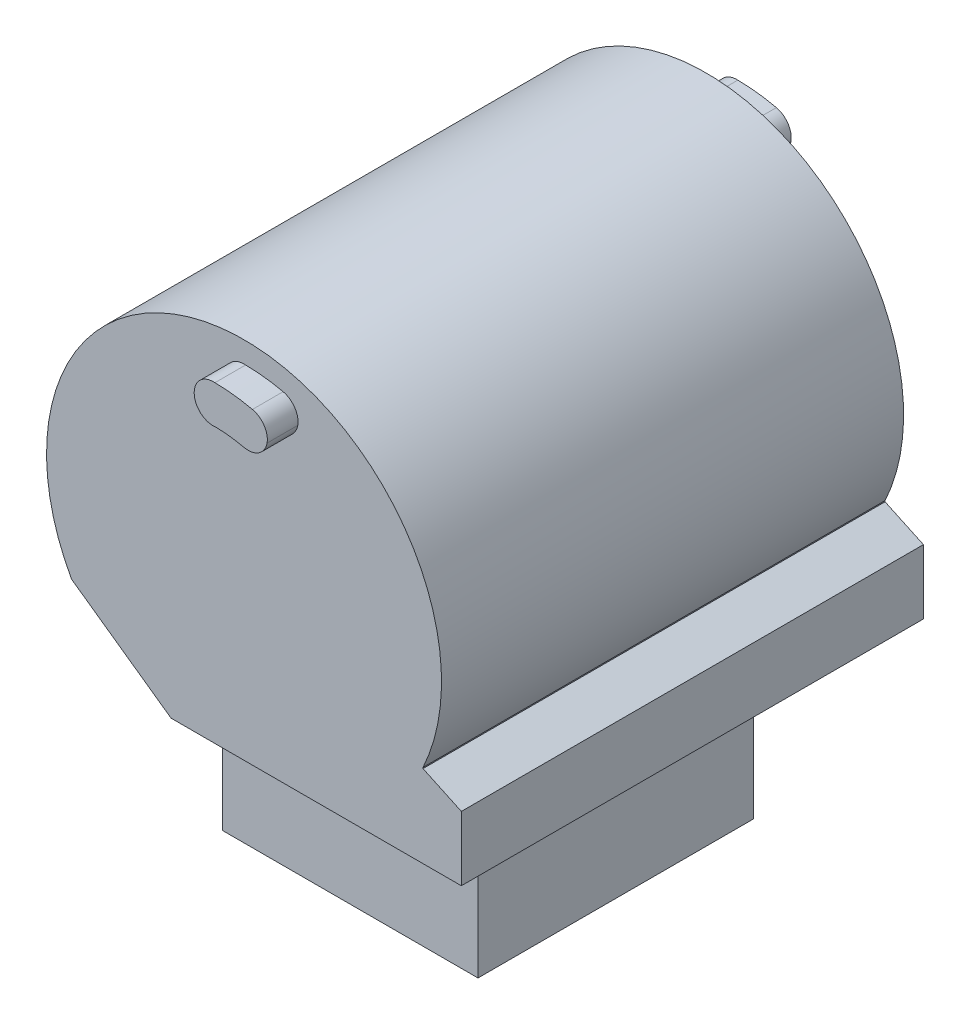
ISO-10303-21;
HEADER;
FILE_DESCRIPTION(('STEP AP214'),'2;1');
FILE_NAME('part.step','',(''),(''),'','','');
FILE_SCHEMA(('AUTOMOTIVE_DESIGN { 1 0 10303 214 1 1 1 1 }'));
ENDSEC;
DATA;
#1=APPLICATION_CONTEXT('core data for automotive mechanical design processes');
#2=APPLICATION_PROTOCOL_DEFINITION('international standard','automotive_design',2000,#1);
#3=PRODUCT_CONTEXT('',#1,'mechanical');
#4=PRODUCT('Part','Part','',(#3));
#5=PRODUCT_RELATED_PRODUCT_CATEGORY('part','',(#4));
#6=PRODUCT_DEFINITION_FORMATION('','',#4);
#7=PRODUCT_DEFINITION_CONTEXT('part definition',#1,'design');
#8=PRODUCT_DEFINITION('design','',#6,#7);
#9=PRODUCT_DEFINITION_SHAPE('','',#8);
#10=(LENGTH_UNIT() NAMED_UNIT(*) SI_UNIT(.MILLI.,.METRE.));
#11=(NAMED_UNIT(*) PLANE_ANGLE_UNIT() SI_UNIT($,.RADIAN.));
#12=(NAMED_UNIT(*) SI_UNIT($,.STERADIAN.) SOLID_ANGLE_UNIT());
#13=UNCERTAINTY_MEASURE_WITH_UNIT(LENGTH_MEASURE(1.E-05),#10,'distance_accuracy_value','');
#14=(GEOMETRIC_REPRESENTATION_CONTEXT(3) GLOBAL_UNCERTAINTY_ASSIGNED_CONTEXT((#13)) GLOBAL_UNIT_ASSIGNED_CONTEXT((#10,
#11,#12)) REPRESENTATION_CONTEXT('',''));
#15=CARTESIAN_POINT('',(0.,0.,0.));
#16=DIRECTION('',(0.,0.,1.));
#17=DIRECTION('',(1.,0.,0.));
#18=AXIS2_PLACEMENT_3D('',#15,#16,#17);
#19=CARTESIAN_POINT('',(0.,0.,30.607));
#20=DIRECTION('',(0.,0.,-1.));
#21=DIRECTION('',(-1.,0.,0.));
#22=AXIS2_PLACEMENT_3D('',#19,#20,#21);
#23=PLANE('',#22);
#24=CARTESIAN_POINT('',(0.,10.414,30.607));
#25=DIRECTION('',(0.,0.,-1.));
#26=DIRECTION('',(-1.,0.,0.));
#27=AXIS2_PLACEMENT_3D('',#24,#25,#26);
#28=CIRCLE('',#27,1.27);
#29=CARTESIAN_POINT('',(0.104978153875677,11.6796538180754,30.607));
#30=VERTEX_POINT('',#29);
#31=CARTESIAN_POINT('',(0.195053245628297,9.15906803715505,30.607));
#32=VERTEX_POINT('',#31);
#33=EDGE_CURVE('E428',#30,#32,#28,.F.);
#34=ORIENTED_EDGE('',*,*,#33,.F.);
#35=CARTESIAN_POINT('',(0.,0.,30.607));
#36=DIRECTION('',(0.,0.,-1.));
#37=DIRECTION('',(-1.,0.,0.));
#38=AXIS2_PLACEMENT_3D('',#35,#36,#37);
#39=CIRCLE('',#38,11.6801255867767);
#40=CARTESIAN_POINT('',(2.58945635168496,11.3894709941065,30.607));
#41=VERTEX_POINT('',#40);
#42=EDGE_CURVE('E315',#30,#41,#39,.T.);
#43=ORIENTED_EDGE('',*,*,#42,.T.);
#44=CARTESIAN_POINT('',(2.30790034081783,10.1510743642885,30.607));
#45=DIRECTION('',(0.,0.,-1.));
#46=DIRECTION('',(-1.,0.,0.));
#47=AXIS2_PLACEMENT_3D('',#44,#45,#46);
#48=CIRCLE('',#47,1.27);
#49=CARTESIAN_POINT('',(3.56092432451261,9.94411809768691,30.607));
#50=VERTEX_POINT('',#49);
#51=EDGE_CURVE('E345',#41,#50,#48,.T.);
#52=ORIENTED_EDGE('',*,*,#51,.T.);
#53=CARTESIAN_POINT('',(2.31150207980372,10.1718109926718,30.607));
#54=DIRECTION('',(0.,0.,-1.));
#55=DIRECTION('',(-1.,0.,0.));
#56=AXIS2_PLACEMENT_3D('',#53,#54,#55);
#57=CIRCLE('',#56,1.27);
#58=CARTESIAN_POINT('',(2.03007490066708,8.93338507932726,30.607));
#59=VERTEX_POINT('',#58);
#60=EDGE_CURVE('E343',#50,#59,#57,.T.);
#61=ORIENTED_EDGE('',*,*,#60,.T.);
#62=CARTESIAN_POINT('',(0.,0.,30.607));
#63=DIRECTION('',(0.,0.,-1.));
#64=DIRECTION('',(-1.,0.,0.));
#65=AXIS2_PLACEMENT_3D('',#62,#63,#64);
#66=CIRCLE('',#65,9.16114474712988);
#67=EDGE_CURVE('E310',#59,#32,#66,.F.);
#68=ORIENTED_EDGE('',*,*,#67,.T.);
#69=EDGE_LOOP('',(#34,#43,#52,#61,#68));
#70=FACE_BOUND('',#69,.T.);
#71=DIRECTION('',(0.81566572491895,-0.578523487157128,0.));
#72=VECTOR('',#71,1.);
#73=CARTESIAN_POINT('',(-11.4224282897632,-6.37500533060302,30.607));
#74=LINE('',#73,#72);
#75=CARTESIAN_POINT('',(-11.4224282897632,-6.37500533060302,30.607));
#76=VERTEX_POINT('',#75);
#77=CARTESIAN_POINT('',(-4.83251909002568,-11.049,30.607));
#78=VERTEX_POINT('',#77);
#79=EDGE_CURVE('E476',#76,#78,#74,.T.);
#80=ORIENTED_EDGE('',*,*,#79,.T.);
#81=DIRECTION('',(1.,0.,0.));
#82=VECTOR('',#81,1.);
#83=CARTESIAN_POINT('',(14.3954121622264,-11.049,30.607));
#84=LINE('',#83,#82);
#85=CARTESIAN_POINT('',(14.3954121622264,-11.049,30.607));
#86=VERTEX_POINT('',#85);
#87=EDGE_CURVE('E497',#78,#86,#84,.T.);
#88=ORIENTED_EDGE('',*,*,#87,.T.);
#89=DIRECTION('',(0.,-1.,0.));
#90=VECTOR('',#89,1.);
#91=CARTESIAN_POINT('',(14.3954121622264,-7.493,30.607));
#92=LINE('',#91,#90);
#93=CARTESIAN_POINT('',(14.3954121622264,-6.78234712897176,30.607));
#94=VERTEX_POINT('',#93);
#95=EDGE_CURVE('E499',#94,#86,#92,.T.);
#96=ORIENTED_EDGE('',*,*,#95,.F.);
#97=DIRECTION('',(0.906307787036647,-0.422618261740705,0.));
#98=VECTOR('',#97,1.);
#99=CARTESIAN_POINT('',(-0.0266798707181564,-0.0572151673934007,30.607));
#100=LINE('',#99,#98);
#101=CARTESIAN_POINT('',(11.8554121622264,-5.59792567725805,30.607));
#102=VERTEX_POINT('',#101);
#103=EDGE_CURVE('E526',#94,#102,#100,.F.);
#104=ORIENTED_EDGE('',*,*,#103,.T.);
#105=DIRECTION('',(0.,-1.,0.));
#106=VECTOR('',#105,1.);
#107=CARTESIAN_POINT('',(11.8554121622264,-5.461,30.607));
#108=LINE('',#107,#106);
#109=CARTESIAN_POINT('',(11.8554121622264,-5.5282694818301,30.607));
#110=VERTEX_POINT('',#109);
#111=EDGE_CURVE('E504',#110,#102,#108,.T.);
#112=ORIENTED_EDGE('',*,*,#111,.F.);
#113=CARTESIAN_POINT('',(0.,0.,30.607));
#114=DIRECTION('',(0.,0.,-1.));
#115=DIRECTION('',(-1.,0.,0.));
#116=AXIS2_PLACEMENT_3D('',#113,#114,#115);
#117=CIRCLE('',#116,13.081);
#118=EDGE_CURVE('E513',#76,#110,#117,.T.);
#119=ORIENTED_EDGE('',*,*,#118,.F.);
#120=EDGE_LOOP('',(#80,#88,#96,#104,#112,#119));
#121=FACE_BOUND('',#120,.T.);
#122=ADVANCED_FACE('F33',(#70,#121),#23,.F.);
#123=CARTESIAN_POINT('',(0.,-11.049,0.));
#124=DIRECTION('',(0.,-1.,0.));
#125=DIRECTION('',(0.,0.,-1.));
#126=AXIS2_PLACEMENT_3D('',#123,#124,#125);
#127=PLANE('',#126);
#128=DIRECTION('',(0.,0.,-1.));
#129=VECTOR('',#128,1.);
#130=CARTESIAN_POINT('',(-7.61242828976322,-11.049,10.9982));
#131=LINE('',#130,#129);
#132=CARTESIAN_POINT('',(-7.61242828976322,-11.049,19.5989448));
#133=VERTEX_POINT('',#132);
#134=CARTESIAN_POINT('',(-7.61242828976322,-11.049,10.9982));
#135=VERTEX_POINT('',#134);
#136=EDGE_CURVE('E263',#133,#135,#131,.T.);
#137=ORIENTED_EDGE('',*,*,#136,.F.);
#138=DIRECTION('',(-1.,0.,0.));
#139=VECTOR('',#138,1.);
#140=CARTESIAN_POINT('',(-7.61242828976322,-11.049,19.5989448));
#141=LINE('',#140,#139);
#142=CARTESIAN_POINT('',(9.31541216222641,-11.049,19.5989448));
#143=VERTEX_POINT('',#142);
#144=EDGE_CURVE('E271',#143,#133,#141,.T.);
#145=ORIENTED_EDGE('',*,*,#144,.F.);
#146=DIRECTION('',(0.,0.,1.));
#147=VECTOR('',#146,1.);
#148=CARTESIAN_POINT('',(9.31541216222641,-11.049,10.9982));
#149=LINE('',#148,#147);
#150=CARTESIAN_POINT('',(9.31541216222641,-11.049,10.9982));
#151=VERTEX_POINT('',#150);
#152=EDGE_CURVE('E268',#151,#143,#149,.T.);
#153=ORIENTED_EDGE('',*,*,#152,.F.);
#154=DIRECTION('',(1.,0.,0.));
#155=VECTOR('',#154,1.);
#156=CARTESIAN_POINT('',(-7.61242828976322,-11.049,10.9982));
#157=LINE('',#156,#155);
#158=EDGE_CURVE('E266',#135,#151,#157,.T.);
#159=ORIENTED_EDGE('',*,*,#158,.F.);
#160=EDGE_LOOP('',(#137,#145,#153,#159));
#161=FACE_BOUND('',#160,.T.);
#162=DIRECTION('',(1.,0.,0.));
#163=VECTOR('',#162,1.);
#164=CARTESIAN_POINT('',(-13.2553278913442,-11.049,26.543));
#165=LINE('',#164,#163);
#166=CARTESIAN_POINT('',(-9.4453278913442,-11.049,26.543));
#167=VERTEX_POINT('',#166);
#168=CARTESIAN_POINT('',(-4.83251909002568,-11.049,26.543));
#169=VERTEX_POINT('',#168);
#170=EDGE_CURVE('E482',#167,#169,#165,.T.);
#171=ORIENTED_EDGE('',*,*,#170,.F.);
#172=DIRECTION('',(0.,0.,-1.));
#173=VECTOR('',#172,1.);
#174=CARTESIAN_POINT('',(-9.4453278913442,-11.049,4.064));
#175=LINE('',#174,#173);
#176=CARTESIAN_POINT('',(-9.4453278913442,-11.049,4.064));
#177=VERTEX_POINT('',#176);
#178=EDGE_CURVE('E537',#167,#177,#175,.T.);
#179=ORIENTED_EDGE('',*,*,#178,.T.);
#180=DIRECTION('',(-1.,0.,0.));
#181=VECTOR('',#180,1.);
#182=CARTESIAN_POINT('',(-4.82801175270534,-11.049,4.064));
#183=LINE('',#182,#181);
#184=CARTESIAN_POINT('',(-4.82801175270534,-11.049,4.064));
#185=VERTEX_POINT('',#184);
#186=EDGE_CURVE('E467',#185,#177,#183,.T.);
#187=ORIENTED_EDGE('',*,*,#186,.F.);
#188=DIRECTION('',(0.,0.,-1.));
#189=VECTOR('',#188,1.);
#190=CARTESIAN_POINT('',(-4.82801175270534,-11.049,4.064));
#191=LINE('',#190,#189);
#192=CARTESIAN_POINT('',(-4.82801175270534,-11.049,0.));
#193=VERTEX_POINT('',#192);
#194=EDGE_CURVE('E472',#185,#193,#191,.T.);
#195=ORIENTED_EDGE('',*,*,#194,.T.);
#196=DIRECTION('',(-1.,0.,0.));
#197=VECTOR('',#196,1.);
#198=CARTESIAN_POINT('',(14.3954121622264,-11.049,0.));
#199=LINE('',#198,#197);
#200=CARTESIAN_POINT('',(14.3954121622264,-11.049,0.));
#201=VERTEX_POINT('',#200);
#202=EDGE_CURVE('E494',#201,#193,#199,.T.);
#203=ORIENTED_EDGE('',*,*,#202,.F.);
#204=DIRECTION('',(0.,0.,-1.));
#205=VECTOR('',#204,1.);
#206=CARTESIAN_POINT('',(14.3954121622264,-11.049,0.));
#207=LINE('',#206,#205);
#208=EDGE_CURVE('E491',#86,#201,#207,.T.);
#209=ORIENTED_EDGE('',*,*,#208,.F.);
#210=ORIENTED_EDGE('',*,*,#87,.F.);
#211=DIRECTION('',(0.,0.,1.));
#212=VECTOR('',#211,1.);
#213=CARTESIAN_POINT('',(-4.83251909002568,-11.049,26.543));
#214=LINE('',#213,#212);
#215=EDGE_CURVE('E484',#169,#78,#214,.T.);
#216=ORIENTED_EDGE('',*,*,#215,.F.);
#217=EDGE_LOOP('',(#171,#179,#187,#195,#203,#209,#210,#216));
#218=FACE_BOUND('',#217,.T.);
#219=ADVANCED_FACE('F559',(#161,#218),#127,.T.);
#220=CARTESIAN_POINT('',(0.,0.,0.));
#221=DIRECTION('',(0.,0.,-1.));
#222=DIRECTION('',(-1.,0.,0.));
#223=AXIS2_PLACEMENT_3D('',#220,#221,#222);
#224=CYLINDRICAL_SURFACE('',#223,13.081);
#225=CARTESIAN_POINT('',(0.,0.,0.));
#226=DIRECTION('',(0.,0.,-1.));
#227=DIRECTION('',(-1.,0.,0.));
#228=AXIS2_PLACEMENT_3D('',#225,#226,#227);
#229=CIRCLE('',#228,13.081);
#230=CARTESIAN_POINT('',(-11.4224282897632,-6.37500533060302,0.));
#231=VERTEX_POINT('',#230);
#232=CARTESIAN_POINT('',(11.8554121622264,-5.5282694818301,0.));
#233=VERTEX_POINT('',#232);
#234=EDGE_CURVE('E515',#231,#233,#229,.T.);
#235=ORIENTED_EDGE('',*,*,#234,.F.);
#236=DIRECTION('',(0.,0.,-1.));
#237=VECTOR('',#236,1.);
#238=CARTESIAN_POINT('',(-11.4224282897632,-6.37500533060302,0.));
#239=LINE('',#238,#237);
#240=CARTESIAN_POINT('',(-11.4224282897632,-6.37500533060302,4.064));
#241=VERTEX_POINT('',#240);
#242=EDGE_CURVE('E529',#231,#241,#239,.F.);
#243=ORIENTED_EDGE('',*,*,#242,.T.);
#244=CARTESIAN_POINT('',(-11.4224282897632,-6.37500533060302,26.543));
#245=VERTEX_POINT('',#244);
#246=EDGE_CURVE('E528',#241,#245,#239,.F.);
#247=ORIENTED_EDGE('',*,*,#246,.T.);
#248=DIRECTION('',(0.,0.,1.));
#249=VECTOR('',#248,1.);
#250=CARTESIAN_POINT('',(-11.4224282897632,-6.37500533060302,26.543));
#251=LINE('',#250,#249);
#252=EDGE_CURVE('E488',#245,#76,#251,.T.);
#253=ORIENTED_EDGE('',*,*,#252,.T.);
#254=ORIENTED_EDGE('',*,*,#118,.T.);
#255=DIRECTION('',(0.,0.,-1.));
#256=VECTOR('',#255,1.);
#257=CARTESIAN_POINT('',(11.8554121622264,-5.5282694818301,0.));
#258=LINE('',#257,#256);
#259=EDGE_CURVE('E510',#110,#233,#258,.T.);
#260=ORIENTED_EDGE('',*,*,#259,.T.);
#261=EDGE_LOOP('',(#235,#243,#247,#253,#254,#260));
#262=FACE_BOUND('',#261,.T.);
#263=ADVANCED_FACE('F570',(#262),#224,.T.);
#264=CARTESIAN_POINT('',(0.,0.,0.));
#265=DIRECTION('',(0.,0.,1.));
#266=DIRECTION('',(1.,0.,0.));
#267=AXIS2_PLACEMENT_3D('',#264,#265,#266);
#268=PLANE('',#267);
#269=CARTESIAN_POINT('',(2.34010026205571,10.1576318894338,0.));
#270=DIRECTION('',(0.,0.,1.));
#271=DIRECTION('',(1.,0.,0.));
#272=AXIS2_PLACEMENT_3D('',#269,#270,#271);
#273=CIRCLE('',#272,1.27);
#274=CARTESIAN_POINT('',(2.05498778956733,8.92004921420294,0.));
#275=VERTEX_POINT('',#274);
#276=CARTESIAN_POINT('',(3.58484087298419,9.90559853547961,0.));
#277=VERTEX_POINT('',#276);
#278=EDGE_CURVE('E347',#275,#277,#273,.T.);
#279=ORIENTED_EDGE('',*,*,#278,.T.);
#280=CARTESIAN_POINT('',(2.33790088909306,10.1465148623933,0.));
#281=DIRECTION('',(0.,0.,1.));
#282=DIRECTION('',(1.,0.,0.));
#283=AXIS2_PLACEMENT_3D('',#280,#281,#282);
#284=CIRCLE('',#283,1.27);
#285=CARTESIAN_POINT('',(2.62305526055589,11.3840878842533,0.));
#286=VERTEX_POINT('',#285);
#287=EDGE_CURVE('E41',#277,#286,#284,.T.);
#288=ORIENTED_EDGE('',*,*,#287,.T.);
#289=CARTESIAN_POINT('',(0.,0.,0.));
#290=DIRECTION('',(0.,0.,1.));
#291=DIRECTION('',(1.,0.,0.));
#292=AXIS2_PLACEMENT_3D('',#289,#290,#291);
#293=CIRCLE('',#292,11.682374581237);
#294=CARTESIAN_POINT('',(0.068032342568311,11.6821764862844,0.));
#295=VERTEX_POINT('',#294);
#296=EDGE_CURVE('E294',#286,#295,#293,.T.);
#297=ORIENTED_EDGE('',*,*,#296,.T.);
#298=CARTESIAN_POINT('',(0.,10.414,0.));
#299=DIRECTION('',(0.,0.,1.));
#300=DIRECTION('',(1.,0.,0.));
#301=AXIS2_PLACEMENT_3D('',#298,#299,#300);
#302=CIRCLE('',#301,1.27);
#303=CARTESIAN_POINT('',(0.14688685714635,9.1525229882405,0.));
#304=VERTEX_POINT('',#303);
#305=EDGE_CURVE('E377',#304,#295,#302,.F.);
#306=ORIENTED_EDGE('',*,*,#305,.F.);
#307=CARTESIAN_POINT('',(0.,0.,0.));
#308=DIRECTION('',(0.,0.,1.));
#309=DIRECTION('',(1.,0.,0.));
#310=AXIS2_PLACEMENT_3D('',#307,#308,#309);
#311=CIRCLE('',#310,9.15370159001664);
#312=EDGE_CURVE('E288',#304,#275,#311,.F.);
#313=ORIENTED_EDGE('',*,*,#312,.T.);
#314=EDGE_LOOP('',(#279,#288,#297,#306,#313));
#315=FACE_BOUND('',#314,.T.);
#316=ORIENTED_EDGE('',*,*,#202,.T.);
#317=DIRECTION('',(0.815852319251068,-0.578260316097043,0.));
#318=VECTOR('',#317,1.);
#319=CARTESIAN_POINT('',(-4.82801175270534,-11.049,0.));
#320=LINE('',#319,#318);
#321=EDGE_CURVE('E419',#231,#193,#320,.T.);
#322=ORIENTED_EDGE('',*,*,#321,.F.);
#323=ORIENTED_EDGE('',*,*,#234,.T.);
#324=DIRECTION('',(0.,-1.,0.));
#325=VECTOR('',#324,1.);
#326=CARTESIAN_POINT('',(11.8554121622264,-5.461,0.));
#327=LINE('',#326,#325);
#328=CARTESIAN_POINT('',(11.8554121622264,-5.59792567725805,0.));
#329=VERTEX_POINT('',#328);
#330=EDGE_CURVE('E507',#233,#329,#327,.T.);
#331=ORIENTED_EDGE('',*,*,#330,.T.);
#332=DIRECTION('',(-0.906307787036647,0.422618261740705,0.));
#333=VECTOR('',#332,1.);
#334=CARTESIAN_POINT('',(-0.0266798707181629,-0.0572151673933997,0.));
#335=LINE('',#334,#333);
#336=CARTESIAN_POINT('',(14.3954121622264,-6.78234712897176,0.));
#337=VERTEX_POINT('',#336);
#338=EDGE_CURVE('E520',#329,#337,#335,.F.);
#339=ORIENTED_EDGE('',*,*,#338,.T.);
#340=DIRECTION('',(0.,-1.,0.));
#341=VECTOR('',#340,1.);
#342=CARTESIAN_POINT('',(14.3954121622264,-7.493,0.));
#343=LINE('',#342,#341);
#344=EDGE_CURVE('E502',#337,#201,#343,.T.);
#345=ORIENTED_EDGE('',*,*,#344,.T.);
#346=EDGE_LOOP('',(#316,#322,#323,#331,#339,#345));
#347=FACE_BOUND('',#346,.T.);
#348=ADVANCED_FACE('F363',(#315,#347),#268,.F.);
#349=CARTESIAN_POINT('',(11.8554121622264,-5.461,0.));
#350=DIRECTION('',(-1.,0.,0.));
#351=DIRECTION('',(0.,0.,1.));
#352=AXIS2_PLACEMENT_3D('',#349,#350,#351);
#353=PLANE('',#352);
#354=ORIENTED_EDGE('',*,*,#111,.T.);
#355=DIRECTION('',(0.,0.,-1.));
#356=VECTOR('',#355,1.);
#357=CARTESIAN_POINT('',(11.8554121622264,-5.59792567725805,0.));
#358=LINE('',#357,#356);
#359=EDGE_CURVE('E517',#102,#329,#358,.T.);
#360=ORIENTED_EDGE('',*,*,#359,.T.);
#361=ORIENTED_EDGE('',*,*,#330,.F.);
#362=ORIENTED_EDGE('',*,*,#259,.F.);
#363=EDGE_LOOP('',(#354,#360,#361,#362));
#364=FACE_BOUND('',#363,.T.);
#365=ADVANCED_FACE('F573',(#364),#353,.F.);
#366=CARTESIAN_POINT('',(14.3954121622264,-7.493,0.));
#367=DIRECTION('',(-1.,0.,0.));
#368=DIRECTION('',(0.,0.,1.));
#369=AXIS2_PLACEMENT_3D('',#366,#367,#368);
#370=PLANE('',#369);
#371=ORIENTED_EDGE('',*,*,#95,.T.);
#372=ORIENTED_EDGE('',*,*,#208,.T.);
#373=ORIENTED_EDGE('',*,*,#344,.F.);
#374=DIRECTION('',(0.,0.,-1.));
#375=VECTOR('',#374,1.);
#376=CARTESIAN_POINT('',(14.3954121622264,-6.78234712897176,0.));
#377=LINE('',#376,#375);
#378=EDGE_CURVE('E523',#337,#94,#377,.F.);
#379=ORIENTED_EDGE('',*,*,#378,.T.);
#380=EDGE_LOOP('',(#371,#372,#373,#379));
#381=FACE_BOUND('',#380,.T.);
#382=ADVANCED_FACE('F581',(#381),#370,.F.);
#383=CARTESIAN_POINT('',(11.8554121622264,-5.59792567725805,0.));
#384=DIRECTION('',(0.422618261740705,0.906307787036647,0.));
#385=DIRECTION('',(0.,0.,1.));
#386=AXIS2_PLACEMENT_3D('',#383,#384,#385);
#387=PLANE('',#386);
#388=ORIENTED_EDGE('',*,*,#103,.F.);
#389=ORIENTED_EDGE('',*,*,#378,.F.);
#390=ORIENTED_EDGE('',*,*,#338,.F.);
#391=ORIENTED_EDGE('',*,*,#359,.F.);
#392=EDGE_LOOP('',(#388,#389,#390,#391));
#393=FACE_BOUND('',#392,.T.);
#394=ADVANCED_FACE('F584',(#393),#387,.T.);
#395=CARTESIAN_POINT('',(-13.4209487694086,-7.493,0.));
#396=DIRECTION('',(0.48821211153372,-0.872725004885151,0.));
#397=DIRECTION('',(0.,0.,-1.));
#398=AXIS2_PLACEMENT_3D('',#395,#396,#397);
#399=PLANE('',#398);
#400=DIRECTION('',(0.872725004885151,0.488212111533719,0.));
#401=VECTOR('',#400,1.);
#402=CARTESIAN_POINT('',(-11.4224282897632,-6.37500533060302,4.064));
#403=LINE('',#402,#401);
#404=CARTESIAN_POINT('',(-13.1518594570219,-7.34246843432227,4.064));
#405=VERTEX_POINT('',#404);
#406=EDGE_CURVE('E470',#405,#241,#403,.T.);
#407=ORIENTED_EDGE('',*,*,#406,.F.);
#408=DIRECTION('',(0.,0.,1.));
#409=VECTOR('',#408,1.);
#410=CARTESIAN_POINT('',(-13.1518594570219,-7.34246843432227,0.));
#411=LINE('',#410,#409);
#412=CARTESIAN_POINT('',(-13.1518594570219,-7.34246843432227,26.543));
#413=VERTEX_POINT('',#412);
#414=EDGE_CURVE('E534',#405,#413,#411,.T.);
#415=ORIENTED_EDGE('',*,*,#414,.T.);
#416=DIRECTION('',(0.87272500488515,0.488212111533721,0.));
#417=VECTOR('',#416,1.);
#418=CARTESIAN_POINT('',(-13.2553278913442,-7.40034983168666,26.543));
#419=LINE('',#418,#417);
#420=EDGE_CURVE('E477',#413,#245,#419,.T.);
#421=ORIENTED_EDGE('',*,*,#420,.T.);
#422=ORIENTED_EDGE('',*,*,#246,.F.);
#423=EDGE_LOOP('',(#407,#415,#421,#422));
#424=FACE_BOUND('',#423,.T.);
#425=ADVANCED_FACE('F551',(#424),#399,.F.);
#426=CARTESIAN_POINT('',(-11.4224282897632,-6.37500533060302,26.543));
#427=DIRECTION('',(-0.578523487157128,-0.81566572491895,0.));
#428=DIRECTION('',(0.81566572491895,-0.578523487157128,0.));
#429=AXIS2_PLACEMENT_3D('',#426,#427,#428);
#430=PLANE('',#429);
#431=ORIENTED_EDGE('',*,*,#79,.F.);
#432=ORIENTED_EDGE('',*,*,#252,.F.);
#433=DIRECTION('',(0.81566572491895,-0.578523487157128,0.));
#434=VECTOR('',#433,1.);
#435=CARTESIAN_POINT('',(-11.4224282897632,-6.37500533060302,26.543));
#436=LINE('',#435,#434);
#437=EDGE_CURVE('E479',#245,#169,#436,.T.);
#438=ORIENTED_EDGE('',*,*,#437,.T.);
#439=ORIENTED_EDGE('',*,*,#215,.T.);
#440=EDGE_LOOP('',(#431,#432,#438,#439));
#441=FACE_BOUND('',#440,.T.);
#442=ADVANCED_FACE('F563',(#441),#430,.T.);
#443=CARTESIAN_POINT('',(0.,0.,26.543));
#444=DIRECTION('',(0.,0.,-1.));
#445=DIRECTION('',(-1.,0.,0.));
#446=AXIS2_PLACEMENT_3D('',#443,#444,#445);
#447=PLANE('',#446);
#448=ORIENTED_EDGE('',*,*,#420,.F.);
#449=DIRECTION('',(0.707106781186544,-0.707106781186551,0.));
#450=VECTOR('',#449,1.);
#451=CARTESIAN_POINT('',(-13.2553278913442,-7.23899999999993,26.543));
#452=LINE('',#451,#450);
#453=EDGE_CURVE('E536',#413,#167,#452,.T.);
#454=ORIENTED_EDGE('',*,*,#453,.T.);
#455=ORIENTED_EDGE('',*,*,#170,.T.);
#456=ORIENTED_EDGE('',*,*,#437,.F.);
#457=EDGE_LOOP('',(#448,#454,#455,#456));
#458=FACE_BOUND('',#457,.T.);
#459=ADVANCED_FACE('F556',(#458),#447,.F.);
#460=CARTESIAN_POINT('',(-4.82801175270534,-11.049,4.064));
#461=DIRECTION('',(0.578260316097043,0.815852319251068,0.));
#462=DIRECTION('',(-0.815852319251068,0.578260316097043,0.));
#463=AXIS2_PLACEMENT_3D('',#460,#461,#462);
#464=PLANE('',#463);
#465=ORIENTED_EDGE('',*,*,#321,.T.);
#466=ORIENTED_EDGE('',*,*,#194,.F.);
#467=DIRECTION('',(0.815852319251068,-0.578260316097043,0.));
#468=VECTOR('',#467,1.);
#469=CARTESIAN_POINT('',(-4.82801175270534,-11.049,4.064));
#470=LINE('',#469,#468);
#471=EDGE_CURVE('E464',#241,#185,#470,.T.);
#472=ORIENTED_EDGE('',*,*,#471,.F.);
#473=ORIENTED_EDGE('',*,*,#242,.F.);
#474=EDGE_LOOP('',(#465,#466,#472,#473));
#475=FACE_BOUND('',#474,.T.);
#476=ADVANCED_FACE('F578',(#475),#464,.F.);
#477=CARTESIAN_POINT('',(0.,0.,4.064));
#478=DIRECTION('',(0.,0.,1.));
#479=DIRECTION('',(1.,0.,0.));
#480=AXIS2_PLACEMENT_3D('',#477,#478,#479);
#481=PLANE('',#480);
#482=ORIENTED_EDGE('',*,*,#186,.T.);
#483=DIRECTION('',(-0.707106781186544,0.707106781186551,0.));
#484=VECTOR('',#483,1.);
#485=CARTESIAN_POINT('',(-13.2553278913442,-7.23899999999993,4.064));
#486=LINE('',#485,#484);
#487=EDGE_CURVE('E451',#177,#405,#486,.T.);
#488=ORIENTED_EDGE('',*,*,#487,.T.);
#489=ORIENTED_EDGE('',*,*,#406,.T.);
#490=ORIENTED_EDGE('',*,*,#471,.T.);
#491=EDGE_LOOP('',(#482,#488,#489,#490));
#492=FACE_BOUND('',#491,.T.);
#493=ADVANCED_FACE('F545',(#492),#481,.F.);
#494=CARTESIAN_POINT('',(0.,10.414,32.639));
#495=DIRECTION('',(0.,0.,-1.));
#496=DIRECTION('',(-1.,0.,0.));
#497=AXIS2_PLACEMENT_3D('',#494,#495,#496);
#498=CYLINDRICAL_SURFACE('',#497,1.27);
#499=CARTESIAN_POINT('',(0.,10.414,32.639));
#500=DIRECTION('',(0.,0.,1.));
#501=DIRECTION('',(1.,0.,0.));
#502=AXIS2_PLACEMENT_3D('',#499,#500,#501);
#503=CIRCLE('',#502,1.27);
#504=CARTESIAN_POINT('',(-0.104978153875657,11.6796538180754,32.639));
#505=VERTEX_POINT('',#504);
#506=CARTESIAN_POINT('',(0.195053245628297,9.15906803715505,32.639));
#507=VERTEX_POINT('',#506);
#508=EDGE_CURVE('E417',#505,#507,#503,.T.);
#509=ORIENTED_EDGE('',*,*,#508,.F.);
#510=CARTESIAN_POINT('',(0.104978153875678,11.6796538180754,32.639));
#511=DIRECTION('',(-1.,0.,0.));
#512=VECTOR('',#511,1.);
#513=LINE('',#510,#512);
#514=CARTESIAN_POINT('',(0.104978153875677,11.6796538180754,32.639));
#515=VERTEX_POINT('',#514);
#516=EDGE_CURVE('E382',#515,#505,#513,.T.);
#517=ORIENTED_EDGE('',*,*,#516,.F.);
#518=DIRECTION('',(0.,0.,1.));
#519=VECTOR('',#518,1.);
#520=CARTESIAN_POINT('',(0.104978153875677,11.6796538180754,30.099));
#521=LINE('',#520,#519);
#522=EDGE_CURVE('E312',#515,#30,#521,.F.);
#523=ORIENTED_EDGE('',*,*,#522,.T.);
#524=ORIENTED_EDGE('',*,*,#33,.T.);
#525=DIRECTION('',(0.,0.,1.));
#526=VECTOR('',#525,1.);
#527=CARTESIAN_POINT('',(0.195053245628297,9.15906803715505,27.559));
#528=LINE('',#527,#526);
#529=EDGE_CURVE('E306',#32,#507,#528,.T.);
#530=ORIENTED_EDGE('',*,*,#529,.T.);
#531=EDGE_LOOP('',(#509,#517,#523,#524,#530));
#532=FACE_BOUND('',#531,.T.);
#533=ADVANCED_FACE('F446',(#532),#498,.T.);
#534=CARTESIAN_POINT('',(0.,10.414,32.639));
#535=DIRECTION('',(0.,0.,1.));
#536=DIRECTION('',(1.,0.,0.));
#537=AXIS2_PLACEMENT_3D('',#534,#535,#536);
#538=PLANE('',#537);
#539=CARTESIAN_POINT('',(0.,0.,32.639));
#540=DIRECTION('',(0.,0.,-1.));
#541=DIRECTION('',(-1.,0.,0.));
#542=AXIS2_PLACEMENT_3D('',#539,#540,#541);
#543=CIRCLE('',#542,9.16114474712988);
#544=CARTESIAN_POINT('',(2.03007490066708,8.93338507932726,32.639));
#545=VERTEX_POINT('',#544);
#546=EDGE_CURVE('E303',#507,#545,#543,.T.);
#547=ORIENTED_EDGE('',*,*,#546,.T.);
#548=CARTESIAN_POINT('',(2.31150207980372,10.1718109926718,32.639));
#549=DIRECTION('',(0.,0.,1.));
#550=DIRECTION('',(1.,0.,0.));
#551=AXIS2_PLACEMENT_3D('',#548,#549,#550);
#552=CIRCLE('',#551,1.27);
#553=CARTESIAN_POINT('',(3.56092432451261,9.94411809768691,32.639));
#554=VERTEX_POINT('',#553);
#555=EDGE_CURVE('E330',#545,#554,#552,.T.);
#556=ORIENTED_EDGE('',*,*,#555,.T.);
#557=CARTESIAN_POINT('',(2.30790034081783,10.1510743642885,32.639));
#558=DIRECTION('',(0.,0.,1.));
#559=DIRECTION('',(1.,0.,0.));
#560=AXIS2_PLACEMENT_3D('',#557,#558,#559);
#561=CIRCLE('',#560,1.27);
#562=CARTESIAN_POINT('',(2.58945635168496,11.3894709941065,32.639));
#563=VERTEX_POINT('',#562);
#564=EDGE_CURVE('E328',#554,#563,#561,.T.);
#565=ORIENTED_EDGE('',*,*,#564,.T.);
#566=CARTESIAN_POINT('',(0.,0.,32.639));
#567=DIRECTION('',(0.,0.,1.));
#568=DIRECTION('',(-1.,0.,0.));
#569=AXIS2_PLACEMENT_3D('',#566,#567,#568);
#570=CIRCLE('',#569,11.6801255867767);
#571=EDGE_CURVE('E307',#563,#515,#570,.T.);
#572=ORIENTED_EDGE('',*,*,#571,.T.);
#573=ORIENTED_EDGE('',*,*,#516,.T.);
#574=ORIENTED_EDGE('',*,*,#508,.T.);
#575=EDGE_LOOP('',(#547,#556,#565,#572,#573,#574));
#576=FACE_BOUND('',#575,.T.);
#577=ADVANCED_FACE('F408',(#576),#538,.T.);
#578=CARTESIAN_POINT('',(0.,10.414,-2.032));
#579=DIRECTION('',(0.,0.,1.));
#580=DIRECTION('',(1.,0.,0.));
#581=AXIS2_PLACEMENT_3D('',#578,#579,#580);
#582=CYLINDRICAL_SURFACE('',#581,1.27);
#583=CARTESIAN_POINT('',(0.,10.414,-2.032));
#584=DIRECTION('',(0.,0.,-1.));
#585=DIRECTION('',(-1.,0.,0.));
#586=AXIS2_PLACEMENT_3D('',#583,#584,#585);
#587=CIRCLE('',#586,1.27);
#588=CARTESIAN_POINT('',(0.146886857146349,9.1525229882405,-2.032));
#589=VERTEX_POINT('',#588);
#590=CARTESIAN_POINT('',(-0.0680323425682728,11.6821764862844,-2.032));
#591=VERTEX_POINT('',#590);
#592=EDGE_CURVE('E381',#589,#591,#587,.T.);
#593=ORIENTED_EDGE('',*,*,#592,.F.);
#594=DIRECTION('',(0.,0.,-1.));
#595=VECTOR('',#594,1.);
#596=CARTESIAN_POINT('',(0.146886857146349,9.1525229882405,-1.016));
#597=LINE('',#596,#595);
#598=EDGE_CURVE('E284',#589,#304,#597,.F.);
#599=ORIENTED_EDGE('',*,*,#598,.T.);
#600=ORIENTED_EDGE('',*,*,#305,.T.);
#601=DIRECTION('',(0.,0.,-1.));
#602=VECTOR('',#601,1.);
#603=CARTESIAN_POINT('',(0.0680323425683109,11.6821764862844,-0.254));
#604=LINE('',#603,#602);
#605=CARTESIAN_POINT('',(0.0680323425683103,11.6821764862844,-2.032));
#606=VERTEX_POINT('',#605);
#607=EDGE_CURVE('E291',#295,#606,#604,.T.);
#608=ORIENTED_EDGE('',*,*,#607,.T.);
#609=CARTESIAN_POINT('',(-0.0680323425682716,11.6821764862844,-2.032));
#610=DIRECTION('',(1.,0.,0.));
#611=VECTOR('',#610,1.);
#612=LINE('',#609,#611);
#613=EDGE_CURVE('E375',#591,#606,#612,.T.);
#614=ORIENTED_EDGE('',*,*,#613,.F.);
#615=EDGE_LOOP('',(#593,#599,#600,#608,#614));
#616=FACE_BOUND('',#615,.T.);
#617=ADVANCED_FACE('F374',(#616),#582,.T.);
#618=CARTESIAN_POINT('',(0.,10.414,-2.032));
#619=DIRECTION('',(0.,0.,-1.));
#620=DIRECTION('',(-1.,0.,0.));
#621=AXIS2_PLACEMENT_3D('',#618,#619,#620);
#622=PLANE('',#621);
#623=CARTESIAN_POINT('',(2.33790088909306,10.1465148623933,-2.032));
#624=DIRECTION('',(0.,0.,-1.));
#625=DIRECTION('',(-1.,0.,0.));
#626=AXIS2_PLACEMENT_3D('',#623,#624,#625);
#627=CIRCLE('',#626,1.27);
#628=CARTESIAN_POINT('',(2.62305526055589,11.3840878842533,-2.032));
#629=VERTEX_POINT('',#628);
#630=CARTESIAN_POINT('',(3.58484087298419,9.90559853547961,-2.032));
#631=VERTEX_POINT('',#630);
#632=EDGE_CURVE('E334',#629,#631,#627,.T.);
#633=ORIENTED_EDGE('',*,*,#632,.T.);
#634=CARTESIAN_POINT('',(2.34010026205571,10.1576318894338,-2.032));
#635=DIRECTION('',(0.,0.,-1.));
#636=DIRECTION('',(-1.,0.,0.));
#637=AXIS2_PLACEMENT_3D('',#634,#635,#636);
#638=CIRCLE('',#637,1.27);
#639=CARTESIAN_POINT('',(2.05498778956733,8.92004921420294,-2.032));
#640=VERTEX_POINT('',#639);
#641=EDGE_CURVE('E336',#631,#640,#638,.T.);
#642=ORIENTED_EDGE('',*,*,#641,.T.);
#643=CARTESIAN_POINT('',(0.,0.,-2.032));
#644=DIRECTION('',(0.,0.,1.));
#645=DIRECTION('',(-1.,0.,0.));
#646=AXIS2_PLACEMENT_3D('',#643,#644,#645);
#647=CIRCLE('',#646,9.15370159001664);
#648=EDGE_CURVE('E282',#640,#589,#647,.T.);
#649=ORIENTED_EDGE('',*,*,#648,.T.);
#650=ORIENTED_EDGE('',*,*,#592,.T.);
#651=ORIENTED_EDGE('',*,*,#613,.T.);
#652=CARTESIAN_POINT('',(0.,0.,-2.032));
#653=DIRECTION('',(0.,0.,-1.));
#654=DIRECTION('',(-1.,0.,0.));
#655=AXIS2_PLACEMENT_3D('',#652,#653,#654);
#656=CIRCLE('',#655,11.682374581237);
#657=EDGE_CURVE('E285',#606,#629,#656,.T.);
#658=ORIENTED_EDGE('',*,*,#657,.T.);
#659=EDGE_LOOP('',(#633,#642,#649,#650,#651,#658));
#660=FACE_BOUND('',#659,.T.);
#661=ADVANCED_FACE('F380',(#660),#622,.T.);
#662=CARTESIAN_POINT('',(-13.2553278913442,-7.23899999999993,0.));
#663=DIRECTION('',(-0.707106781186551,-0.707106781186544,0.));
#664=DIRECTION('',(0.,0.,-1.));
#665=AXIS2_PLACEMENT_3D('',#662,#663,#664);
#666=PLANE('',#665);
#667=ORIENTED_EDGE('',*,*,#487,.F.);
#668=ORIENTED_EDGE('',*,*,#178,.F.);
#669=ORIENTED_EDGE('',*,*,#453,.F.);
#670=ORIENTED_EDGE('',*,*,#414,.F.);
#671=EDGE_LOOP('',(#667,#668,#669,#670));
#672=FACE_BOUND('',#671,.T.);
#673=ADVANCED_FACE('F402',(#672),#666,.T.);
#674=CARTESIAN_POINT('',(0.,0.,27.559));
#675=DIRECTION('',(0.,0.,1.));
#676=DIRECTION('',(1.,0.,0.));
#677=AXIS2_PLACEMENT_3D('',#674,#675,#676);
#678=CYLINDRICAL_SURFACE('',#677,11.6801255867767);
#679=ORIENTED_EDGE('',*,*,#571,.F.);
#680=DIRECTION('',(0.,0.,1.));
#681=VECTOR('',#680,1.);
#682=CARTESIAN_POINT('',(2.58945635168496,11.3894709941065,27.559));
#683=LINE('',#682,#681);
#684=EDGE_CURVE('E332',#563,#41,#683,.F.);
#685=ORIENTED_EDGE('',*,*,#684,.T.);
#686=ORIENTED_EDGE('',*,*,#42,.F.);
#687=ORIENTED_EDGE('',*,*,#522,.F.);
#688=EDGE_LOOP('',(#679,#685,#686,#687));
#689=FACE_BOUND('',#688,.T.);
#690=ADVANCED_FACE('F403',(#689),#678,.T.);
#691=CARTESIAN_POINT('',(0.,0.,27.559));
#692=DIRECTION('',(0.,0.,1.));
#693=DIRECTION('',(1.,0.,0.));
#694=AXIS2_PLACEMENT_3D('',#691,#692,#693);
#695=CYLINDRICAL_SURFACE('',#694,9.16114474712988);
#696=ORIENTED_EDGE('',*,*,#67,.F.);
#697=DIRECTION('',(0.,0.,1.));
#698=VECTOR('',#697,1.);
#699=CARTESIAN_POINT('',(2.03007490066708,8.93338507932726,27.559));
#700=LINE('',#699,#698);
#701=EDGE_CURVE('E326',#59,#545,#700,.T.);
#702=ORIENTED_EDGE('',*,*,#701,.T.);
#703=ORIENTED_EDGE('',*,*,#546,.F.);
#704=ORIENTED_EDGE('',*,*,#529,.F.);
#705=EDGE_LOOP('',(#696,#702,#703,#704));
#706=FACE_BOUND('',#705,.T.);
#707=ADVANCED_FACE('F443',(#706),#695,.F.);
#708=CARTESIAN_POINT('',(0.,0.,1.524));
#709=DIRECTION('',(0.,0.,-1.));
#710=DIRECTION('',(-1.,0.,0.));
#711=AXIS2_PLACEMENT_3D('',#708,#709,#710);
#712=CYLINDRICAL_SURFACE('',#711,11.682374581237);
#713=ORIENTED_EDGE('',*,*,#296,.F.);
#714=DIRECTION('',(0.,0.,-1.));
#715=VECTOR('',#714,1.);
#716=CARTESIAN_POINT('',(2.62305526055589,11.3840878842533,1.524));
#717=LINE('',#716,#715);
#718=EDGE_CURVE('E341',#286,#629,#717,.T.);
#719=ORIENTED_EDGE('',*,*,#718,.T.);
#720=ORIENTED_EDGE('',*,*,#657,.F.);
#721=ORIENTED_EDGE('',*,*,#607,.F.);
#722=EDGE_LOOP('',(#713,#719,#720,#721));
#723=FACE_BOUND('',#722,.T.);
#724=ADVANCED_FACE('F369',(#723),#712,.T.);
#725=CARTESIAN_POINT('',(0.,0.,1.524));
#726=DIRECTION('',(0.,0.,-1.));
#727=DIRECTION('',(-1.,0.,0.));
#728=AXIS2_PLACEMENT_3D('',#725,#726,#727);
#729=CYLINDRICAL_SURFACE('',#728,9.15370159001664);
#730=ORIENTED_EDGE('',*,*,#648,.F.);
#731=DIRECTION('',(0.,0.,-1.));
#732=VECTOR('',#731,1.);
#733=CARTESIAN_POINT('',(2.05498778956733,8.92004921420294,1.524));
#734=LINE('',#733,#732);
#735=EDGE_CURVE('E338',#640,#275,#734,.F.);
#736=ORIENTED_EDGE('',*,*,#735,.T.);
#737=ORIENTED_EDGE('',*,*,#312,.F.);
#738=ORIENTED_EDGE('',*,*,#598,.F.);
#739=EDGE_LOOP('',(#730,#736,#737,#738));
#740=FACE_BOUND('',#739,.T.);
#741=ADVANCED_FACE('F733',(#740),#729,.F.);
#742=CARTESIAN_POINT('',(2.30790034081783,10.1510743642885,27.559));
#743=DIRECTION('',(0.,0.,1.));
#744=DIRECTION('',(1.,0.,0.));
#745=AXIS2_PLACEMENT_3D('',#742,#743,#744);
#746=CYLINDRICAL_SURFACE('',#745,1.27);
#747=DIRECTION('',(0.,0.,1.));
#748=VECTOR('',#747,1.);
#749=CARTESIAN_POINT('',(3.56092432451261,9.94411809768691,31.623));
#750=LINE('',#749,#748);
#751=EDGE_CURVE('E300',#50,#554,#750,.T.);
#752=ORIENTED_EDGE('',*,*,#751,.F.);
#753=ORIENTED_EDGE('',*,*,#51,.F.);
#754=ORIENTED_EDGE('',*,*,#684,.F.);
#755=ORIENTED_EDGE('',*,*,#564,.F.);
#756=EDGE_LOOP('',(#752,#753,#754,#755));
#757=FACE_BOUND('',#756,.T.);
#758=ADVANCED_FACE('F433',(#757),#746,.T.);
#759=CARTESIAN_POINT('',(2.31150207980372,10.1718109926718,27.559));
#760=DIRECTION('',(0.,0.,1.));
#761=DIRECTION('',(1.,0.,0.));
#762=AXIS2_PLACEMENT_3D('',#759,#760,#761);
#763=CYLINDRICAL_SURFACE('',#762,1.27);
#764=ORIENTED_EDGE('',*,*,#60,.F.);
#765=ORIENTED_EDGE('',*,*,#751,.T.);
#766=ORIENTED_EDGE('',*,*,#555,.F.);
#767=ORIENTED_EDGE('',*,*,#701,.F.);
#768=EDGE_LOOP('',(#764,#765,#766,#767));
#769=FACE_BOUND('',#768,.T.);
#770=ADVANCED_FACE('F438',(#769),#763,.T.);
#771=CARTESIAN_POINT('',(2.33790088909306,10.1465148623933,1.524));
#772=DIRECTION('',(0.,0.,-1.));
#773=DIRECTION('',(-1.,0.,0.));
#774=AXIS2_PLACEMENT_3D('',#771,#772,#773);
#775=CYLINDRICAL_SURFACE('',#774,1.27);
#776=ORIENTED_EDGE('',*,*,#718,.F.);
#777=ORIENTED_EDGE('',*,*,#287,.F.);
#778=DIRECTION('',(0.,0.,-1.));
#779=VECTOR('',#778,1.);
#780=CARTESIAN_POINT('',(3.58484087298419,9.90559853547961,-1.016));
#781=LINE('',#780,#779);
#782=EDGE_CURVE('E281',#631,#277,#781,.F.);
#783=ORIENTED_EDGE('',*,*,#782,.F.);
#784=ORIENTED_EDGE('',*,*,#632,.F.);
#785=EDGE_LOOP('',(#776,#777,#783,#784));
#786=FACE_BOUND('',#785,.T.);
#787=ADVANCED_FACE('F35',(#786),#775,.T.);
#788=CARTESIAN_POINT('',(2.34010026205571,10.1576318894338,1.524));
#789=DIRECTION('',(0.,0.,-1.));
#790=DIRECTION('',(-1.,0.,0.));
#791=AXIS2_PLACEMENT_3D('',#788,#789,#790);
#792=CYLINDRICAL_SURFACE('',#791,1.27);
#793=ORIENTED_EDGE('',*,*,#278,.F.);
#794=ORIENTED_EDGE('',*,*,#735,.F.);
#795=ORIENTED_EDGE('',*,*,#641,.F.);
#796=ORIENTED_EDGE('',*,*,#782,.T.);
#797=EDGE_LOOP('',(#793,#794,#795,#796));
#798=FACE_BOUND('',#797,.T.);
#799=ADVANCED_FACE('F355',(#798),#792,.T.);
#800=CARTESIAN_POINT('',(-7.61242828976322,-18.669,10.9982));
#801=DIRECTION('',(1.,0.,0.));
#802=DIRECTION('',(0.,0.,-1.));
#803=AXIS2_PLACEMENT_3D('',#800,#801,#802);
#804=PLANE('',#803);
#805=DIRECTION('',(0.,1.,0.));
#806=VECTOR('',#805,1.);
#807=CARTESIAN_POINT('',(-7.61242828976322,-18.669,10.9982));
#808=LINE('',#807,#806);
#809=CARTESIAN_POINT('',(-7.61242828976322,-15.875,10.9982));
#810=VERTEX_POINT('',#809);
#811=EDGE_CURVE('E279',#810,#135,#808,.T.);
#812=ORIENTED_EDGE('',*,*,#811,.F.);
#813=DIRECTION('',(0.,0.,-1.));
#814=VECTOR('',#813,1.);
#815=CARTESIAN_POINT('',(-7.61242828976322,-15.875,6.1722));
#816=LINE('',#815,#814);
#817=CARTESIAN_POINT('',(-7.61242828976322,-15.875,6.1722));
#818=VERTEX_POINT('',#817);
#819=EDGE_CURVE('E245',#810,#818,#816,.T.);
#820=ORIENTED_EDGE('',*,*,#819,.T.);
#821=DIRECTION('',(0.,-1.,0.));
#822=VECTOR('',#821,1.);
#823=CARTESIAN_POINT('',(-7.61242828976322,-21.971,6.1722));
#824=LINE('',#823,#822);
#825=CARTESIAN_POINT('',(-7.61242828976322,-21.971,6.1722));
#826=VERTEX_POINT('',#825);
#827=EDGE_CURVE('E227',#818,#826,#824,.T.);
#828=ORIENTED_EDGE('',*,*,#827,.T.);
#829=DIRECTION('',(0.,0.,1.));
#830=VECTOR('',#829,1.);
#831=CARTESIAN_POINT('',(-7.61242828976322,-21.971,6.1722));
#832=LINE('',#831,#830);
#833=CARTESIAN_POINT('',(-7.61242828976322,-21.971,24.4249448));
#834=VERTEX_POINT('',#833);
#835=EDGE_CURVE('E235',#826,#834,#832,.T.);
#836=ORIENTED_EDGE('',*,*,#835,.T.);
#837=DIRECTION('',(0.,1.,0.));
#838=VECTOR('',#837,1.);
#839=CARTESIAN_POINT('',(-7.61242828976322,-21.971,24.4249448));
#840=LINE('',#839,#838);
#841=CARTESIAN_POINT('',(-7.61242828976322,-15.875,24.4249448));
#842=VERTEX_POINT('',#841);
#843=EDGE_CURVE('E241',#834,#842,#840,.T.);
#844=ORIENTED_EDGE('',*,*,#843,.T.);
#845=CARTESIAN_POINT('',(-7.61242828976322,-15.875,19.5989448));
#846=VERTEX_POINT('',#845);
#847=EDGE_CURVE('E232',#842,#846,#816,.T.);
#848=ORIENTED_EDGE('',*,*,#847,.T.);
#849=DIRECTION('',(0.,1.,0.));
#850=VECTOR('',#849,1.);
#851=CARTESIAN_POINT('',(-7.61242828976322,-18.669,19.5989448));
#852=LINE('',#851,#850);
#853=EDGE_CURVE('E274',#846,#133,#852,.T.);
#854=ORIENTED_EDGE('',*,*,#853,.T.);
#855=ORIENTED_EDGE('',*,*,#136,.T.);
#856=EDGE_LOOP('',(#812,#820,#828,#836,#844,#848,#854,#855));
#857=FACE_BOUND('',#856,.T.);
#858=ADVANCED_FACE('F243',(#857),#804,.F.);
#859=CARTESIAN_POINT('',(-7.61242828976322,-18.669,10.9982));
#860=DIRECTION('',(0.,0.,1.));
#861=DIRECTION('',(1.,0.,0.));
#862=AXIS2_PLACEMENT_3D('',#859,#860,#861);
#863=PLANE('',#862);
#864=DIRECTION('',(0.,1.,0.));
#865=VECTOR('',#864,1.);
#866=CARTESIAN_POINT('',(9.31541216222641,-18.669,10.9982));
#867=LINE('',#866,#865);
#868=CARTESIAN_POINT('',(9.31541216222641,-15.875,10.9982));
#869=VERTEX_POINT('',#868);
#870=EDGE_CURVE('E53',#869,#151,#867,.T.);
#871=ORIENTED_EDGE('',*,*,#870,.F.);
#872=DIRECTION('',(-1.,0.,0.));
#873=VECTOR('',#872,1.);
#874=CARTESIAN_POINT('',(-7.61242828976322,-15.875,10.9982));
#875=LINE('',#874,#873);
#876=EDGE_CURVE('E48',#869,#810,#875,.T.);
#877=ORIENTED_EDGE('',*,*,#876,.T.);
#878=ORIENTED_EDGE('',*,*,#811,.T.);
#879=ORIENTED_EDGE('',*,*,#158,.T.);
#880=EDGE_LOOP('',(#871,#877,#878,#879));
#881=FACE_BOUND('',#880,.T.);
#882=ADVANCED_FACE('F788',(#881),#863,.F.);
#883=CARTESIAN_POINT('',(9.31541216222641,-18.669,10.9982));
#884=DIRECTION('',(-1.,0.,0.));
#885=DIRECTION('',(0.,0.,1.));
#886=AXIS2_PLACEMENT_3D('',#883,#884,#885);
#887=PLANE('',#886);
#888=DIRECTION('',(0.,0.,1.));
#889=VECTOR('',#888,1.);
#890=CARTESIAN_POINT('',(9.31541216222641,-15.875,6.17220000000001));
#891=LINE('',#890,#889);
#892=CARTESIAN_POINT('',(9.31541216222641,-15.875,6.1722));
#893=VERTEX_POINT('',#892);
#894=EDGE_CURVE('E880',#893,#869,#891,.T.);
#895=ORIENTED_EDGE('',*,*,#894,.T.);
#896=ORIENTED_EDGE('',*,*,#870,.T.);
#897=ORIENTED_EDGE('',*,*,#152,.T.);
#898=DIRECTION('',(0.,1.,0.));
#899=VECTOR('',#898,1.);
#900=CARTESIAN_POINT('',(9.31541216222641,-18.669,19.5989448));
#901=LINE('',#900,#899);
#902=CARTESIAN_POINT('',(9.31541216222641,-15.875,19.5989448));
#903=VERTEX_POINT('',#902);
#904=EDGE_CURVE('E276',#903,#143,#901,.T.);
#905=ORIENTED_EDGE('',*,*,#904,.F.);
#906=CARTESIAN_POINT('',(9.31541216222641,-15.875,24.4249448));
#907=VERTEX_POINT('',#906);
#908=EDGE_CURVE('E868',#903,#907,#891,.T.);
#909=ORIENTED_EDGE('',*,*,#908,.T.);
#910=DIRECTION('',(0.,-1.,0.));
#911=VECTOR('',#910,1.);
#912=CARTESIAN_POINT('',(9.31541216222641,-21.971,24.4249448));
#913=LINE('',#912,#911);
#914=CARTESIAN_POINT('',(9.31541216222641,-21.971,24.4249448));
#915=VERTEX_POINT('',#914);
#916=EDGE_CURVE('E256',#907,#915,#913,.T.);
#917=ORIENTED_EDGE('',*,*,#916,.T.);
#918=DIRECTION('',(0.,0.,-1.));
#919=VECTOR('',#918,1.);
#920=CARTESIAN_POINT('',(9.31541216222641,-21.971,6.17220000000001));
#921=LINE('',#920,#919);
#922=CARTESIAN_POINT('',(9.31541216222641,-21.971,6.1722));
#923=VERTEX_POINT('',#922);
#924=EDGE_CURVE('E260',#915,#923,#921,.T.);
#925=ORIENTED_EDGE('',*,*,#924,.T.);
#926=DIRECTION('',(0.,1.,0.));
#927=VECTOR('',#926,1.);
#928=CARTESIAN_POINT('',(9.31541216222641,-21.971,6.1722));
#929=LINE('',#928,#927);
#930=EDGE_CURVE('E228',#923,#893,#929,.T.);
#931=ORIENTED_EDGE('',*,*,#930,.T.);
#932=EDGE_LOOP('',(#895,#896,#897,#905,#909,#917,#925,#931));
#933=FACE_BOUND('',#932,.T.);
#934=ADVANCED_FACE('F799',(#933),#887,.F.);
#935=CARTESIAN_POINT('',(-7.61242828976322,-18.669,19.5989448));
#936=DIRECTION('',(0.,0.,-1.));
#937=DIRECTION('',(-1.,0.,0.));
#938=AXIS2_PLACEMENT_3D('',#935,#936,#937);
#939=PLANE('',#938);
#940=ORIENTED_EDGE('',*,*,#853,.F.);
#941=DIRECTION('',(1.,0.,0.));
#942=VECTOR('',#941,1.);
#943=CARTESIAN_POINT('',(-7.61242828976322,-15.875,19.5989448));
#944=LINE('',#943,#942);
#945=EDGE_CURVE('E11',#846,#903,#944,.T.);
#946=ORIENTED_EDGE('',*,*,#945,.T.);
#947=ORIENTED_EDGE('',*,*,#904,.T.);
#948=ORIENTED_EDGE('',*,*,#144,.T.);
#949=EDGE_LOOP('',(#940,#946,#947,#948));
#950=FACE_BOUND('',#949,.T.);
#951=ADVANCED_FACE('F808',(#950),#939,.F.);
#952=CARTESIAN_POINT('',(28.5592139886309,-15.875,6.1722));
#953=DIRECTION('',(0.,1.,0.));
#954=DIRECTION('',(0.,0.,1.));
#955=AXIS2_PLACEMENT_3D('',#952,#953,#954);
#956=PLANE('',#955);
#957=ORIENTED_EDGE('',*,*,#876,.F.);
#958=ORIENTED_EDGE('',*,*,#894,.F.);
#959=DIRECTION('',(-1.,0.,0.));
#960=VECTOR('',#959,1.);
#961=CARTESIAN_POINT('',(28.5592139886309,-15.875,6.1722));
#962=LINE('',#961,#960);
#963=EDGE_CURVE('E254',#893,#818,#962,.T.);
#964=ORIENTED_EDGE('',*,*,#963,.T.);
#965=ORIENTED_EDGE('',*,*,#819,.F.);
#966=EDGE_LOOP('',(#957,#958,#964,#965));
#967=FACE_BOUND('',#966,.T.);
#968=ADVANCED_FACE('F818',(#967),#956,.T.);
#969=ORIENTED_EDGE('',*,*,#945,.F.);
#970=ORIENTED_EDGE('',*,*,#847,.F.);
#971=DIRECTION('',(-1.,0.,0.));
#972=VECTOR('',#971,1.);
#973=CARTESIAN_POINT('',(28.5592139886309,-15.875,24.4249448));
#974=LINE('',#973,#972);
#975=EDGE_CURVE('E257',#907,#842,#974,.T.);
#976=ORIENTED_EDGE('',*,*,#975,.F.);
#977=ORIENTED_EDGE('',*,*,#908,.F.);
#978=EDGE_LOOP('',(#969,#970,#976,#977));
#979=FACE_BOUND('',#978,.T.);
#980=ADVANCED_FACE('F827',(#979),#956,.T.);
#981=CARTESIAN_POINT('',(28.5592139886309,-21.971,6.1722));
#982=DIRECTION('',(0.,0.,-1.));
#983=DIRECTION('',(-1.,0.,0.));
#984=AXIS2_PLACEMENT_3D('',#981,#982,#983);
#985=PLANE('',#984);
#986=ORIENTED_EDGE('',*,*,#930,.F.);
#987=DIRECTION('',(-1.,0.,0.));
#988=VECTOR('',#987,1.);
#989=CARTESIAN_POINT('',(28.5592139886309,-21.971,6.1722));
#990=LINE('',#989,#988);
#991=EDGE_CURVE('E222',#923,#826,#990,.T.);
#992=ORIENTED_EDGE('',*,*,#991,.T.);
#993=ORIENTED_EDGE('',*,*,#827,.F.);
#994=ORIENTED_EDGE('',*,*,#963,.F.);
#995=EDGE_LOOP('',(#986,#992,#993,#994));
#996=FACE_BOUND('',#995,.T.);
#997=ADVANCED_FACE('F224',(#996),#985,.T.);
#998=CARTESIAN_POINT('',(28.5592139886309,-21.971,24.4249448));
#999=DIRECTION('',(0.,0.,1.));
#1000=DIRECTION('',(1.,0.,0.));
#1001=AXIS2_PLACEMENT_3D('',#998,#999,#1000);
#1002=PLANE('',#1001);
#1003=ORIENTED_EDGE('',*,*,#916,.F.);
#1004=ORIENTED_EDGE('',*,*,#975,.T.);
#1005=ORIENTED_EDGE('',*,*,#843,.F.);
#1006=DIRECTION('',(-1.,0.,0.));
#1007=VECTOR('',#1006,1.);
#1008=CARTESIAN_POINT('',(28.5592139886309,-21.971,24.4249448));
#1009=LINE('',#1008,#1007);
#1010=EDGE_CURVE('E231',#915,#834,#1009,.T.);
#1011=ORIENTED_EDGE('',*,*,#1010,.F.);
#1012=EDGE_LOOP('',(#1003,#1004,#1005,#1011));
#1013=FACE_BOUND('',#1012,.T.);
#1014=ADVANCED_FACE('F845',(#1013),#1002,.T.);
#1015=CARTESIAN_POINT('',(28.5592139886309,-21.971,6.1722));
#1016=DIRECTION('',(0.,-1.,0.));
#1017=DIRECTION('',(0.,0.,-1.));
#1018=AXIS2_PLACEMENT_3D('',#1015,#1016,#1017);
#1019=PLANE('',#1018);
#1020=ORIENTED_EDGE('',*,*,#924,.F.);
#1021=ORIENTED_EDGE('',*,*,#1010,.T.);
#1022=ORIENTED_EDGE('',*,*,#835,.F.);
#1023=ORIENTED_EDGE('',*,*,#991,.F.);
#1024=EDGE_LOOP('',(#1020,#1021,#1022,#1023));
#1025=FACE_BOUND('',#1024,.T.);
#1026=ADVANCED_FACE('F236',(#1025),#1019,.T.);
#1027=CLOSED_SHELL('',(#122,#219,#263,#348,#365,#382,#394,#425,#442,#459,#476,#493,#533,#577,
#617,#661,#673,#690,#707,#724,#741,#758,#770,#787,#799,#858,#882,#934,#951,#968,#980,#997,#1014,#1026));
#1028=MANIFOLD_SOLID_BREP('B2',#1027);
#1029=ADVANCED_BREP_SHAPE_REPRESENTATION('',(#18,#1028),#14);
#1030=SHAPE_DEFINITION_REPRESENTATION(#9,#1029);
ENDSEC;
END-ISO-10303-21;
